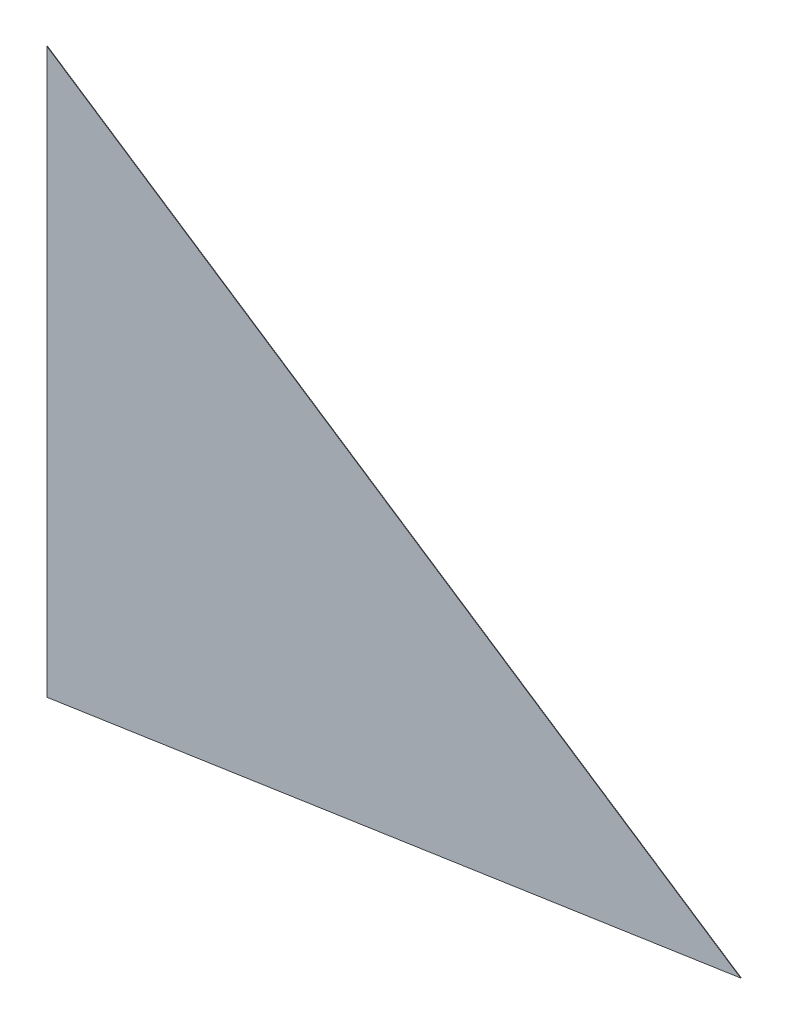
ISO-10303-21;
HEADER;
FILE_DESCRIPTION(('STEP AP214'),'2;1');
FILE_NAME('part.step','',(''),(''),'','','');
FILE_SCHEMA(('AUTOMOTIVE_DESIGN { 1 0 10303 214 1 1 1 1 }'));
ENDSEC;
DATA;
#1=APPLICATION_CONTEXT('core data for automotive mechanical design processes');
#2=APPLICATION_PROTOCOL_DEFINITION('international standard','automotive_design',2000,#1);
#3=PRODUCT_CONTEXT('',#1,'mechanical');
#4=PRODUCT('Part','Part','',(#3));
#5=PRODUCT_RELATED_PRODUCT_CATEGORY('part','',(#4));
#6=PRODUCT_DEFINITION_FORMATION('','',#4);
#7=PRODUCT_DEFINITION_CONTEXT('part definition',#1,'design');
#8=PRODUCT_DEFINITION('design','',#6,#7);
#9=PRODUCT_DEFINITION_SHAPE('','',#8);
#10=(LENGTH_UNIT() NAMED_UNIT(*) SI_UNIT(.MILLI.,.METRE.));
#11=(NAMED_UNIT(*) PLANE_ANGLE_UNIT() SI_UNIT($,.RADIAN.));
#12=(NAMED_UNIT(*) SI_UNIT($,.STERADIAN.) SOLID_ANGLE_UNIT());
#13=UNCERTAINTY_MEASURE_WITH_UNIT(LENGTH_MEASURE(1.E-05),#10,'distance_accuracy_value','');
#14=(GEOMETRIC_REPRESENTATION_CONTEXT(3) GLOBAL_UNCERTAINTY_ASSIGNED_CONTEXT((#13)) GLOBAL_UNIT_ASSIGNED_CONTEXT((#10,
#11,#12)) REPRESENTATION_CONTEXT('',''));
#15=CARTESIAN_POINT('',(0.,0.,0.));
#16=DIRECTION('',(0.,0.,1.));
#17=DIRECTION('',(1.,0.,0.));
#18=AXIS2_PLACEMENT_3D('',#15,#16,#17);
#19=CARTESIAN_POINT('',(-233.875284897176,-176.840766639277,0.5));
#20=DIRECTION('',(-0.552689714472757,-0.833387112640952,0.));
#21=DIRECTION('',(0.833387112640952,-0.552689714472757,0.));
#22=AXIS2_PLACEMENT_3D('',#19,#20,#21);
#23=PLANE('',#22);
#24=DIRECTION('',(-0.833387112640952,0.552689714472757,0.));
#25=VECTOR('',#24,1.);
#26=CARTESIAN_POINT('',(-233.875284897176,-176.840766639277,0.));
#27=LINE('',#26,#25);
#28=CARTESIAN_POINT('',(-233.875284897176,-176.840766639277,0.));
#29=VERTEX_POINT('',#28);
#30=CARTESIAN_POINT('',(-903.923901621273,267.525330511609,0.));
#31=VERTEX_POINT('',#30);
#32=EDGE_CURVE('E81',#29,#31,#27,.T.);
#33=ORIENTED_EDGE('',*,*,#32,.T.);
#34=DIRECTION('',(0.,0.,-1.));
#35=VECTOR('',#34,1.);
#36=CARTESIAN_POINT('',(-903.923901621273,267.525330511609,0.5));
#37=LINE('',#36,#35);
#38=CARTESIAN_POINT('',(-903.923901621273,267.525330511609,0.5));
#39=VERTEX_POINT('',#38);
#40=EDGE_CURVE('E11',#39,#31,#37,.T.);
#41=ORIENTED_EDGE('',*,*,#40,.F.);
#42=DIRECTION('',(-0.833387112640952,0.552689714472757,0.));
#43=VECTOR('',#42,1.);
#44=CARTESIAN_POINT('',(-233.875284897176,-176.840766639277,0.5));
#45=LINE('',#44,#43);
#46=CARTESIAN_POINT('',(-233.875284897176,-176.840766639277,0.5));
#47=VERTEX_POINT('',#46);
#48=EDGE_CURVE('E76',#47,#39,#45,.T.);
#49=ORIENTED_EDGE('',*,*,#48,.F.);
#50=DIRECTION('',(0.,0.,-1.));
#51=VECTOR('',#50,1.);
#52=CARTESIAN_POINT('',(-233.875284897176,-176.840766639277,0.5));
#53=LINE('',#52,#51);
#54=EDGE_CURVE('E51',#47,#29,#53,.T.);
#55=ORIENTED_EDGE('',*,*,#54,.T.);
#56=EDGE_LOOP('',(#33,#41,#49,#55));
#57=FACE_BOUND('',#56,.T.);
#58=ADVANCED_FACE('F35',(#57),#23,.F.);
#59=CARTESIAN_POINT('',(-903.923901621273,267.525330511609,0.5));
#60=DIRECTION('',(1.,0.,0.));
#61=DIRECTION('',(0.,0.,-1.));
#62=AXIS2_PLACEMENT_3D('',#59,#60,#61);
#63=PLANE('',#62);
#64=DIRECTION('',(0.,-1.,0.));
#65=VECTOR('',#64,1.);
#66=CARTESIAN_POINT('',(-903.923901621273,267.525330511609,0.));
#67=LINE('',#66,#65);
#68=CARTESIAN_POINT('',(-903.923901621273,-277.009091384816,0.));
#69=VERTEX_POINT('',#68);
#70=EDGE_CURVE('E84',#31,#69,#67,.T.);
#71=ORIENTED_EDGE('',*,*,#70,.T.);
#72=DIRECTION('',(0.,0.,-1.));
#73=VECTOR('',#72,1.);
#74=CARTESIAN_POINT('',(-903.923901621273,-277.009091384816,0.5));
#75=LINE('',#74,#73);
#76=CARTESIAN_POINT('',(-903.923901621273,-277.009091384816,0.5));
#77=VERTEX_POINT('',#76);
#78=EDGE_CURVE('E43',#77,#69,#75,.T.);
#79=ORIENTED_EDGE('',*,*,#78,.F.);
#80=DIRECTION('',(0.,-1.,0.));
#81=VECTOR('',#80,1.);
#82=CARTESIAN_POINT('',(-903.923901621273,267.525330511609,0.5));
#83=LINE('',#82,#81);
#84=EDGE_CURVE('E69',#39,#77,#83,.T.);
#85=ORIENTED_EDGE('',*,*,#84,.F.);
#86=ORIENTED_EDGE('',*,*,#40,.T.);
#87=EDGE_LOOP('',(#71,#79,#85,#86));
#88=FACE_BOUND('',#87,.T.);
#89=ADVANCED_FACE('F71',(#88),#63,.F.);
#90=CARTESIAN_POINT('',(-233.875284897176,-176.840766639277,0.5));
#91=DIRECTION('',(0.147851118919844,-0.989009629191825,0.));
#92=DIRECTION('',(0.989009629191824,0.147851118919844,0.));
#93=AXIS2_PLACEMENT_3D('',#90,#91,#92);
#94=PLANE('',#93);
#95=DIRECTION('',(-0.989009629191825,-0.147851118919844,0.));
#96=VECTOR('',#95,1.);
#97=CARTESIAN_POINT('',(-233.875284897176,-176.840766639277,0.));
#98=LINE('',#97,#96);
#99=EDGE_CURVE('E79',#29,#69,#98,.T.);
#100=ORIENTED_EDGE('',*,*,#99,.F.);
#101=ORIENTED_EDGE('',*,*,#54,.F.);
#102=DIRECTION('',(-0.989009629191825,-0.147851118919844,0.));
#103=VECTOR('',#102,1.);
#104=CARTESIAN_POINT('',(-233.875284897176,-176.840766639277,0.5));
#105=LINE('',#104,#103);
#106=EDGE_CURVE('E75',#47,#77,#105,.T.);
#107=ORIENTED_EDGE('',*,*,#106,.T.);
#108=ORIENTED_EDGE('',*,*,#78,.T.);
#109=EDGE_LOOP('',(#100,#101,#107,#108));
#110=FACE_BOUND('',#109,.T.);
#111=ADVANCED_FACE('F90',(#110),#94,.T.);
#112=CARTESIAN_POINT('',(0.,0.,0.5));
#113=DIRECTION('',(0.,0.,1.));
#114=DIRECTION('',(1.,0.,0.));
#115=AXIS2_PLACEMENT_3D('',#112,#113,#114);
#116=PLANE('',#115);
#117=ORIENTED_EDGE('',*,*,#48,.T.);
#118=ORIENTED_EDGE('',*,*,#84,.T.);
#119=ORIENTED_EDGE('',*,*,#106,.F.);
#120=EDGE_LOOP('',(#117,#118,#119));
#121=FACE_BOUND('',#120,.T.);
#122=ADVANCED_FACE('F78',(#121),#116,.T.);
#123=CARTESIAN_POINT('',(0.,0.,0.));
#124=DIRECTION('',(0.,0.,1.));
#125=DIRECTION('',(1.,0.,0.));
#126=AXIS2_PLACEMENT_3D('',#123,#124,#125);
#127=PLANE('',#126);
#128=ORIENTED_EDGE('',*,*,#32,.F.);
#129=ORIENTED_EDGE('',*,*,#99,.T.);
#130=ORIENTED_EDGE('',*,*,#70,.F.);
#131=EDGE_LOOP('',(#128,#129,#130));
#132=FACE_BOUND('',#131,.T.);
#133=ADVANCED_FACE('F97',(#132),#127,.F.);
#134=CLOSED_SHELL('',(#58,#89,#111,#122,#133));
#135=MANIFOLD_SOLID_BREP('B2',#134);
#136=ADVANCED_BREP_SHAPE_REPRESENTATION('',(#18,#135),#14);
#137=SHAPE_DEFINITION_REPRESENTATION(#9,#136);
ENDSEC;
END-ISO-10303-21;
